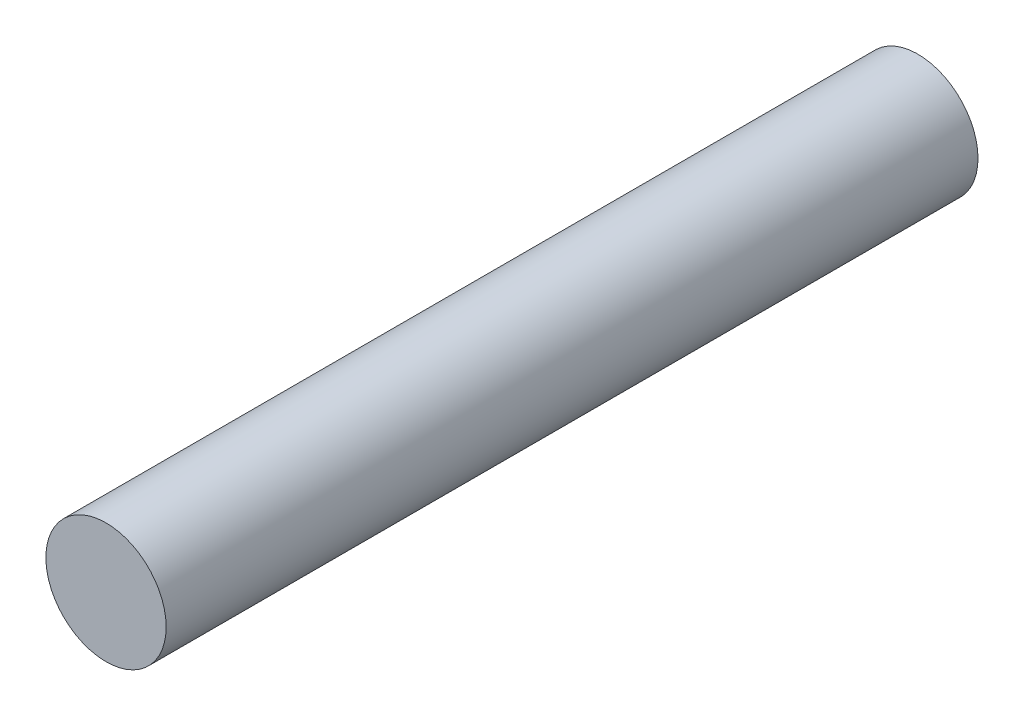
ISO-10303-21;
HEADER;
FILE_DESCRIPTION(('STEP AP214'),'2;1');
FILE_NAME('part.step','',(''),(''),'','','');
FILE_SCHEMA(('AUTOMOTIVE_DESIGN { 1 0 10303 214 1 1 1 1 }'));
ENDSEC;
DATA;
#1=APPLICATION_CONTEXT('core data for automotive mechanical design processes');
#2=APPLICATION_PROTOCOL_DEFINITION('international standard','automotive_design',2000,#1);
#3=PRODUCT_CONTEXT('',#1,'mechanical');
#4=PRODUCT('Part','Part','',(#3));
#5=PRODUCT_RELATED_PRODUCT_CATEGORY('part','',(#4));
#6=PRODUCT_DEFINITION_FORMATION('','',#4);
#7=PRODUCT_DEFINITION_CONTEXT('part definition',#1,'design');
#8=PRODUCT_DEFINITION('design','',#6,#7);
#9=PRODUCT_DEFINITION_SHAPE('','',#8);
#10=(LENGTH_UNIT() NAMED_UNIT(*) SI_UNIT(.MILLI.,.METRE.));
#11=(NAMED_UNIT(*) PLANE_ANGLE_UNIT() SI_UNIT($,.RADIAN.));
#12=(NAMED_UNIT(*) SI_UNIT($,.STERADIAN.) SOLID_ANGLE_UNIT());
#13=UNCERTAINTY_MEASURE_WITH_UNIT(LENGTH_MEASURE(1.E-05),#10,'distance_accuracy_value','');
#14=(GEOMETRIC_REPRESENTATION_CONTEXT(3) GLOBAL_UNCERTAINTY_ASSIGNED_CONTEXT((#13)) GLOBAL_UNIT_ASSIGNED_CONTEXT((#10,
#11,#12)) REPRESENTATION_CONTEXT('',''));
#15=CARTESIAN_POINT('',(0.,0.,0.));
#16=DIRECTION('',(0.,0.,1.));
#17=DIRECTION('',(1.,0.,0.));
#18=AXIS2_PLACEMENT_3D('',#15,#16,#17);
#19=CARTESIAN_POINT('',(0.,0.,13.5));
#20=DIRECTION('',(0.,0.,-1.));
#21=DIRECTION('',(-1.,0.,0.));
#22=AXIS2_PLACEMENT_3D('',#19,#20,#21);
#23=CYLINDRICAL_SURFACE('',#22,1.);
#24=CARTESIAN_POINT('',(0.,0.,13.5));
#25=DIRECTION('',(0.,0.,1.));
#26=DIRECTION('',(1.,0.,0.));
#27=AXIS2_PLACEMENT_3D('',#24,#25,#26);
#28=CIRCLE('',#27,1.);
#29=CARTESIAN_POINT('',(1.,0.,13.5));
#30=VERTEX_POINT('',#29);
#31=EDGE_CURVE('E10',#30,#30,#28,.T.);
#32=ORIENTED_EDGE('',*,*,#31,.F.);
#33=EDGE_LOOP('',(#32));
#34=FACE_BOUND('',#33,.T.);
#35=CARTESIAN_POINT('',(0.,0.,0.));
#36=DIRECTION('',(0.,0.,1.));
#37=DIRECTION('',(1.,0.,0.));
#38=AXIS2_PLACEMENT_3D('',#35,#36,#37);
#39=CIRCLE('',#38,1.);
#40=CARTESIAN_POINT('',(1.,0.,0.));
#41=VERTEX_POINT('',#40);
#42=EDGE_CURVE('E38',#41,#41,#39,.T.);
#43=ORIENTED_EDGE('',*,*,#42,.T.);
#44=EDGE_LOOP('',(#43));
#45=FACE_BOUND('',#44,.T.);
#46=ADVANCED_FACE('F35',(#34,#45),#23,.T.);
#47=CARTESIAN_POINT('',(0.,0.,13.5));
#48=DIRECTION('',(0.,0.,1.));
#49=DIRECTION('',(1.,0.,0.));
#50=AXIS2_PLACEMENT_3D('',#47,#48,#49);
#51=PLANE('',#50);
#52=ORIENTED_EDGE('',*,*,#31,.T.);
#53=EDGE_LOOP('',(#52));
#54=FACE_BOUND('',#53,.T.);
#55=ADVANCED_FACE('F52',(#54),#51,.T.);
#56=CARTESIAN_POINT('',(0.,0.,0.));
#57=DIRECTION('',(0.,0.,1.));
#58=DIRECTION('',(1.,0.,0.));
#59=AXIS2_PLACEMENT_3D('',#56,#57,#58);
#60=PLANE('',#59);
#61=ORIENTED_EDGE('',*,*,#42,.F.);
#62=EDGE_LOOP('',(#61));
#63=FACE_BOUND('',#62,.T.);
#64=ADVANCED_FACE('F50',(#63),#60,.F.);
#65=CLOSED_SHELL('',(#46,#55,#64));
#66=MANIFOLD_SOLID_BREP('B2',#65);
#67=ADVANCED_BREP_SHAPE_REPRESENTATION('',(#18,#66),#14);
#68=SHAPE_DEFINITION_REPRESENTATION(#9,#67);
ENDSEC;
END-ISO-10303-21;
